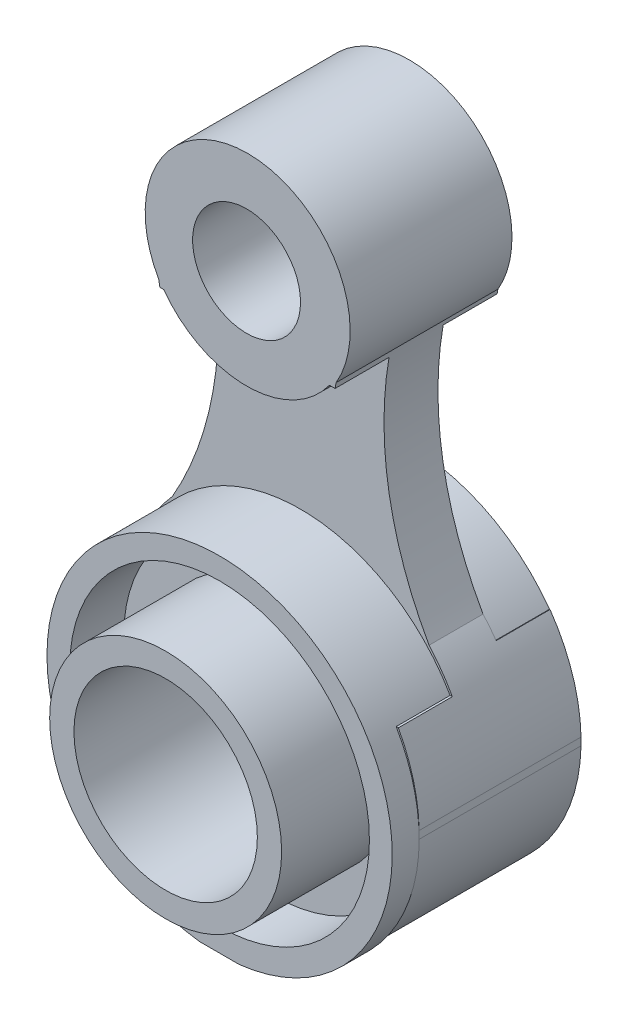
ISO-10303-21;
HEADER;
FILE_DESCRIPTION(('STEP AP214'),'2;1');
FILE_NAME('part.step','',(''),(''),'','','');
FILE_SCHEMA(('AUTOMOTIVE_DESIGN { 1 0 10303 214 1 1 1 1 }'));
ENDSEC;
DATA;
#1=APPLICATION_CONTEXT('core data for automotive mechanical design processes');
#2=APPLICATION_PROTOCOL_DEFINITION('international standard','automotive_design',2000,#1);
#3=PRODUCT_CONTEXT('',#1,'mechanical');
#4=PRODUCT('Part','Part','',(#3));
#5=PRODUCT_RELATED_PRODUCT_CATEGORY('part','',(#4));
#6=PRODUCT_DEFINITION_FORMATION('','',#4);
#7=PRODUCT_DEFINITION_CONTEXT('part definition',#1,'design');
#8=PRODUCT_DEFINITION('design','',#6,#7);
#9=PRODUCT_DEFINITION_SHAPE('','',#8);
#10=(LENGTH_UNIT() NAMED_UNIT(*) SI_UNIT(.MILLI.,.METRE.));
#11=(NAMED_UNIT(*) PLANE_ANGLE_UNIT() SI_UNIT($,.RADIAN.));
#12=(NAMED_UNIT(*) SI_UNIT($,.STERADIAN.) SOLID_ANGLE_UNIT());
#13=UNCERTAINTY_MEASURE_WITH_UNIT(LENGTH_MEASURE(1.E-05),#10,'distance_accuracy_value','');
#14=(GEOMETRIC_REPRESENTATION_CONTEXT(3) GLOBAL_UNCERTAINTY_ASSIGNED_CONTEXT((#13)) GLOBAL_UNIT_ASSIGNED_CONTEXT((#10,
#11,#12)) REPRESENTATION_CONTEXT('',''));
#15=CARTESIAN_POINT('',(0.,0.,0.));
#16=DIRECTION('',(0.,0.,1.));
#17=DIRECTION('',(1.,0.,0.));
#18=AXIS2_PLACEMENT_3D('',#15,#16,#17);
#19=CARTESIAN_POINT('',(-79.2157966897572,22.8891170006504,0.));
#20=DIRECTION('',(0.,0.,1.));
#21=DIRECTION('',(1.,0.,0.));
#22=AXIS2_PLACEMENT_3D('',#19,#20,#21);
#23=CYLINDRICAL_SURFACE('',#22,64.);
#24=CARTESIAN_POINT('',(-79.2157966897572,22.8891170006504,0.));
#25=DIRECTION('',(0.,0.,1.));
#26=DIRECTION('',(1.,0.,0.));
#27=AXIS2_PLACEMENT_3D('',#24,#25,#26);
#28=CIRCLE('',#27,64.);
#29=CARTESIAN_POINT('',(-16.2899481455641,34.5654856567557,0.));
#30=VERTEX_POINT('',#29);
#31=CARTESIAN_POINT('',(-16.1113721325283,33.5583063466604,0.));
#32=VERTEX_POINT('',#31);
#33=EDGE_CURVE('E342',#30,#32,#28,.F.);
#34=ORIENTED_EDGE('',*,*,#33,.T.);
#35=DIRECTION('',(0.,0.,-1.));
#36=VECTOR('',#35,1.);
#37=CARTESIAN_POINT('',(-16.1113721325283,33.5583063466604,10.));
#38=LINE('',#37,#36);
#39=CARTESIAN_POINT('',(-16.1113721325283,33.5583063466604,10.));
#40=VERTEX_POINT('',#39);
#41=EDGE_CURVE('E279',#40,#32,#38,.T.);
#42=ORIENTED_EDGE('',*,*,#41,.F.);
#43=CARTESIAN_POINT('',(-79.2157966897572,22.8891170006504,10.));
#44=DIRECTION('',(0.,0.,-1.));
#45=DIRECTION('',(-1.,0.,0.));
#46=AXIS2_PLACEMENT_3D('',#43,#44,#45);
#47=CIRCLE('',#46,64.);
#48=CARTESIAN_POINT('',(-23.7637123793236,-9.06501177214765,10.));
#49=VERTEX_POINT('',#48);
#50=EDGE_CURVE('E249',#49,#40,#47,.F.);
#51=ORIENTED_EDGE('',*,*,#50,.F.);
#52=DIRECTION('',(0.,0.,1.));
#53=VECTOR('',#52,1.);
#54=CARTESIAN_POINT('',(-23.7637123793236,-9.06501177214765,0.));
#55=LINE('',#54,#53);
#56=CARTESIAN_POINT('',(-23.7637123793236,-9.06501177214764,20.));
#57=VERTEX_POINT('',#56);
#58=EDGE_CURVE('E357',#49,#57,#55,.T.);
#59=ORIENTED_EDGE('',*,*,#58,.T.);
#60=CARTESIAN_POINT('',(-79.2157966897572,22.8891170006504,20.));
#61=DIRECTION('',(0.,0.,1.));
#62=DIRECTION('',(1.,0.,0.));
#63=AXIS2_PLACEMENT_3D('',#60,#61,#62);
#64=CIRCLE('',#63,64.);
#65=CARTESIAN_POINT('',(-16.0773225899418,33.354922671832,20.));
#66=VERTEX_POINT('',#65);
#67=EDGE_CURVE('E288',#66,#57,#64,.F.);
#68=ORIENTED_EDGE('',*,*,#67,.F.);
#69=DIRECTION('',(0.,0.,1.));
#70=VECTOR('',#69,1.);
#71=CARTESIAN_POINT('',(-16.0773225899418,33.354922671832,20.));
#72=LINE('',#71,#70);
#73=CARTESIAN_POINT('',(-16.0773225899418,33.354922671832,30.));
#74=VERTEX_POINT('',#73);
#75=EDGE_CURVE('E329',#66,#74,#72,.T.);
#76=ORIENTED_EDGE('',*,*,#75,.T.);
#77=CARTESIAN_POINT('',(-79.2157966897572,22.8891170006504,30.));
#78=DIRECTION('',(0.,0.,1.));
#79=DIRECTION('',(1.,0.,0.));
#80=AXIS2_PLACEMENT_3D('',#77,#78,#79);
#81=CIRCLE('',#80,64.);
#82=CARTESIAN_POINT('',(-16.2899481455641,34.5654856567557,30.));
#83=VERTEX_POINT('',#82);
#84=EDGE_CURVE('E337',#83,#74,#81,.F.);
#85=ORIENTED_EDGE('',*,*,#84,.F.);
#86=DIRECTION('',(0.,0.,1.));
#87=VECTOR('',#86,1.);
#88=CARTESIAN_POINT('',(-16.2899481455641,34.5654856567557,0.));
#89=LINE('',#88,#87);
#90=EDGE_CURVE('E353',#30,#83,#89,.T.);
#91=ORIENTED_EDGE('',*,*,#90,.F.);
#92=EDGE_LOOP('',(#34,#42,#51,#59,#68,#76,#85,#91));
#93=FACE_BOUND('',#92,.T.);
#94=ADVANCED_FACE('F49',(#93),#23,.F.);
#95=CARTESIAN_POINT('',(79.4760640881105,22.4812265287025,0.));
#96=DIRECTION('',(0.,0.,1.));
#97=DIRECTION('',(1.,0.,0.));
#98=AXIS2_PLACEMENT_3D('',#95,#96,#97);
#99=CYLINDRICAL_SURFACE('',#98,64.);
#100=CARTESIAN_POINT('',(79.4760640881105,22.4812265287025,10.));
#101=DIRECTION('',(0.,0.,-1.));
#102=DIRECTION('',(-1.,0.,0.));
#103=AXIS2_PLACEMENT_3D('',#100,#101,#102);
#104=CIRCLE('',#103,64.);
#105=CARTESIAN_POINT('',(16.4419598055351,33.5583063466604,10.));
#106=VERTEX_POINT('',#105);
#107=CARTESIAN_POINT('',(23.837475779621,-9.14704391149731,10.));
#108=VERTEX_POINT('',#107);
#109=EDGE_CURVE('E64',#106,#108,#104,.F.);
#110=ORIENTED_EDGE('',*,*,#109,.F.);
#111=DIRECTION('',(0.,0.,-1.));
#112=VECTOR('',#111,1.);
#113=CARTESIAN_POINT('',(16.4419598055351,33.5583063466604,10.));
#114=LINE('',#113,#112);
#115=CARTESIAN_POINT('',(16.4419598055351,33.5583063466604,0.));
#116=VERTEX_POINT('',#115);
#117=EDGE_CURVE('E272',#106,#116,#114,.T.);
#118=ORIENTED_EDGE('',*,*,#117,.T.);
#119=CARTESIAN_POINT('',(79.4760640881105,22.4812265287025,0.));
#120=DIRECTION('',(0.,0.,1.));
#121=DIRECTION('',(1.,0.,0.));
#122=AXIS2_PLACEMENT_3D('',#119,#120,#121);
#123=CIRCLE('',#122,64.);
#124=CARTESIAN_POINT('',(16.5943250753563,34.3928552473901,0.));
#125=VERTEX_POINT('',#124);
#126=EDGE_CURVE('E336',#116,#125,#123,.F.);
#127=ORIENTED_EDGE('',*,*,#126,.T.);
#128=DIRECTION('',(0.,0.,1.));
#129=VECTOR('',#128,1.);
#130=CARTESIAN_POINT('',(16.5943250753563,34.3928552473901,0.));
#131=LINE('',#130,#129);
#132=CARTESIAN_POINT('',(16.5943250753563,34.3928552473901,30.));
#133=VERTEX_POINT('',#132);
#134=EDGE_CURVE('E346',#125,#133,#131,.T.);
#135=ORIENTED_EDGE('',*,*,#134,.T.);
#136=CARTESIAN_POINT('',(79.4760640881105,22.4812265287025,30.));
#137=DIRECTION('',(0.,0.,1.));
#138=DIRECTION('',(1.,0.,0.));
#139=AXIS2_PLACEMENT_3D('',#136,#137,#138);
#140=CIRCLE('',#139,64.);
#141=CARTESIAN_POINT('',(16.4065569377697,33.354922671832,30.));
#142=VERTEX_POINT('',#141);
#143=EDGE_CURVE('E317',#142,#133,#140,.F.);
#144=ORIENTED_EDGE('',*,*,#143,.F.);
#145=DIRECTION('',(0.,0.,1.));
#146=VECTOR('',#145,1.);
#147=CARTESIAN_POINT('',(16.4065569377697,33.354922671832,20.));
#148=LINE('',#147,#146);
#149=CARTESIAN_POINT('',(16.4065569377697,33.354922671832,20.));
#150=VERTEX_POINT('',#149);
#151=EDGE_CURVE('E318',#150,#142,#148,.T.);
#152=ORIENTED_EDGE('',*,*,#151,.F.);
#153=CARTESIAN_POINT('',(79.4760640881105,22.4812265287025,20.));
#154=DIRECTION('',(0.,0.,1.));
#155=DIRECTION('',(1.,0.,0.));
#156=AXIS2_PLACEMENT_3D('',#153,#154,#155);
#157=CIRCLE('',#156,64.);
#158=CARTESIAN_POINT('',(23.837475779621,-9.14704391149731,20.));
#159=VERTEX_POINT('',#158);
#160=EDGE_CURVE('E302',#159,#150,#157,.F.);
#161=ORIENTED_EDGE('',*,*,#160,.F.);
#162=DIRECTION('',(0.,0.,1.));
#163=VECTOR('',#162,1.);
#164=CARTESIAN_POINT('',(23.837475779621,-9.14704391149731,0.));
#165=LINE('',#164,#163);
#166=EDGE_CURVE('E359',#108,#159,#165,.T.);
#167=ORIENTED_EDGE('',*,*,#166,.F.);
#168=EDGE_LOOP('',(#110,#118,#127,#135,#144,#152,#161,#167));
#169=FACE_BOUND('',#168,.T.);
#170=ADVANCED_FACE('F488',(#169),#99,.F.);
#171=CARTESIAN_POINT('',(0.,0.,0.));
#172=DIRECTION('',(0.,0.,1.));
#173=DIRECTION('',(1.,0.,0.));
#174=AXIS2_PLACEMENT_3D('',#171,#172,#173);
#175=PLANE('',#174);
#176=CARTESIAN_POINT('',(0.,44.,0.));
#177=DIRECTION('',(0.,0.,1.));
#178=DIRECTION('',(1.,0.,0.));
#179=AXIS2_PLACEMENT_3D('',#176,#177,#178);
#180=CIRCLE('',#179,10.);
#181=CARTESIAN_POINT('',(10.,44.,0.));
#182=VERTEX_POINT('',#181);
#183=EDGE_CURVE('E375',#182,#182,#180,.T.);
#184=ORIENTED_EDGE('',*,*,#183,.T.);
#185=EDGE_LOOP('',(#184));
#186=FACE_BOUND('',#185,.T.);
#187=DIRECTION('',(-1.,0.,0.));
#188=VECTOR('',#187,1.);
#189=CARTESIAN_POINT('',(0.,33.5583063466604,0.));
#190=LINE('',#189,#188);
#191=CARTESIAN_POINT('',(15.5041896160927,33.5583063466604,0.));
#192=VERTEX_POINT('',#191);
#193=EDGE_CURVE('E264',#116,#192,#190,.T.);
#194=ORIENTED_EDGE('',*,*,#193,.T.);
#195=CARTESIAN_POINT('',(0.,44.5410247873855,0.));
#196=DIRECTION('',(0.,0.,-1.));
#197=DIRECTION('',(-1.,0.,0.));
#198=AXIS2_PLACEMENT_3D('',#195,#196,#197);
#199=CIRCLE('',#198,19.);
#200=CARTESIAN_POINT('',(-15.5041896160927,33.5583063466604,0.));
#201=VERTEX_POINT('',#200);
#202=EDGE_CURVE('E263',#192,#201,#199,.T.);
#203=ORIENTED_EDGE('',*,*,#202,.T.);
#204=EDGE_CURVE('E260',#201,#32,#190,.T.);
#205=ORIENTED_EDGE('',*,*,#204,.T.);
#206=ORIENTED_EDGE('',*,*,#33,.F.);
#207=CARTESIAN_POINT('',(0.202169338467999,44.,0.));
#208=DIRECTION('',(0.,0.,1.));
#209=DIRECTION('',(1.,0.,0.));
#210=AXIS2_PLACEMENT_3D('',#207,#208,#209);
#211=CIRCLE('',#210,19.);
#212=EDGE_CURVE('E334',#125,#30,#211,.T.);
#213=ORIENTED_EDGE('',*,*,#212,.F.);
#214=ORIENTED_EDGE('',*,*,#126,.F.);
#215=EDGE_LOOP('',(#194,#203,#205,#206,#213,#214));
#216=FACE_BOUND('',#215,.T.);
#217=ADVANCED_FACE('F481',(#186,#216),#175,.F.);
#218=CARTESIAN_POINT('',(0.,0.,30.));
#219=DIRECTION('',(0.,0.,-1.));
#220=DIRECTION('',(-1.,0.,0.));
#221=AXIS2_PLACEMENT_3D('',#218,#219,#220);
#222=PLANE('',#221);
#223=CARTESIAN_POINT('',(0.,-30.5075512242365,30.));
#224=DIRECTION('',(0.,0.,-1.));
#225=DIRECTION('',(-1.,0.,0.));
#226=AXIS2_PLACEMENT_3D('',#223,#224,#225);
#227=CIRCLE('',#226,32.0077572504167);
#228=CARTESIAN_POINT('',(28.1392759995127,-15.2537756121182,30.));
#229=VERTEX_POINT('',#228);
#230=CARTESIAN_POINT('',(32.,-29.802906489917,30.));
#231=VERTEX_POINT('',#230);
#232=EDGE_CURVE('E57',#229,#231,#227,.T.);
#233=ORIENTED_EDGE('',*,*,#232,.F.);
#234=DIRECTION('',(1.,0.,0.));
#235=VECTOR('',#234,1.);
#236=CARTESIAN_POINT('',(0.,-15.2537756121182,30.));
#237=LINE('',#236,#235);
#238=CARTESIAN_POINT('',(27.7367773911532,-15.2537756121182,30.));
#239=VERTEX_POINT('',#238);
#240=EDGE_CURVE('E313',#239,#229,#237,.T.);
#241=ORIENTED_EDGE('',*,*,#240,.F.);
#242=CARTESIAN_POINT('',(0.,-31.2121959585564,30.));
#243=DIRECTION('',(0.,0.,1.));
#244=DIRECTION('',(1.,0.,0.));
#245=AXIS2_PLACEMENT_3D('',#242,#243,#244);
#246=CIRCLE('',#245,32.);
#247=CARTESIAN_POINT('',(32.,-31.2121959585562,30.));
#248=VERTEX_POINT('',#247);
#249=EDGE_CURVE('E401',#248,#239,#246,.T.);
#250=ORIENTED_EDGE('',*,*,#249,.F.);
#251=DIRECTION('',(0.,-1.,0.));
#252=VECTOR('',#251,1.);
#253=CARTESIAN_POINT('',(32.,63.,30.));
#254=LINE('',#253,#252);
#255=EDGE_CURVE('E412',#231,#248,#254,.T.);
#256=ORIENTED_EDGE('',*,*,#255,.F.);
#257=EDGE_LOOP('',(#233,#241,#250,#256));
#258=FACE_BOUND('',#257,.T.);
#259=ADVANCED_FACE('F442',(#258),#222,.F.);
#260=CARTESIAN_POINT('',(0.,44.,30.));
#261=DIRECTION('',(0.,0.,1.));
#262=DIRECTION('',(1.,0.,0.));
#263=AXIS2_PLACEMENT_3D('',#260,#261,#262);
#264=CIRCLE('',#263,10.);
#265=CARTESIAN_POINT('',(10.,44.,30.));
#266=VERTEX_POINT('',#265);
#267=EDGE_CURVE('E374',#266,#266,#264,.T.);
#268=ORIENTED_EDGE('',*,*,#267,.F.);
#269=EDGE_LOOP('',(#268));
#270=FACE_BOUND('',#269,.T.);
#271=DIRECTION('',(1.,0.,0.));
#272=VECTOR('',#271,1.);
#273=CARTESIAN_POINT('',(0.,33.354922671832,30.));
#274=LINE('',#273,#272);
#275=CARTESIAN_POINT('',(15.3580962186207,33.354922671832,30.));
#276=VERTEX_POINT('',#275);
#277=EDGE_CURVE('E286',#276,#142,#274,.T.);
#278=ORIENTED_EDGE('',*,*,#277,.T.);
#279=ORIENTED_EDGE('',*,*,#143,.T.);
#280=CARTESIAN_POINT('',(0.202169338467999,44.,30.));
#281=DIRECTION('',(0.,0.,-1.));
#282=DIRECTION('',(-1.,0.,0.));
#283=AXIS2_PLACEMENT_3D('',#280,#281,#282);
#284=CIRCLE('',#283,19.);
#285=EDGE_CURVE('E11',#83,#133,#284,.T.);
#286=ORIENTED_EDGE('',*,*,#285,.F.);
#287=ORIENTED_EDGE('',*,*,#84,.T.);
#288=CARTESIAN_POINT('',(-15.3580962186207,33.354922671832,30.));
#289=VERTEX_POINT('',#288);
#290=EDGE_CURVE('E307',#74,#289,#274,.T.);
#291=ORIENTED_EDGE('',*,*,#290,.T.);
#292=CARTESIAN_POINT('',(0.,44.5410247873854,30.));
#293=DIRECTION('',(0.,0.,1.));
#294=DIRECTION('',(1.,0.,0.));
#295=AXIS2_PLACEMENT_3D('',#292,#293,#294);
#296=CIRCLE('',#295,19.);
#297=EDGE_CURVE('E269',#289,#276,#296,.T.);
#298=ORIENTED_EDGE('',*,*,#297,.T.);
#299=EDGE_LOOP('',(#278,#279,#286,#287,#291,#298));
#300=FACE_BOUND('',#299,.T.);
#301=ADVANCED_FACE('F500',(#270,#300),#222,.F.);
#302=CARTESIAN_POINT('',(-32.,63.,45.));
#303=DIRECTION('',(1.,0.,0.));
#304=DIRECTION('',(0.,1.,0.));
#305=AXIS2_PLACEMENT_3D('',#302,#303,#304);
#306=PLANE('',#305);
#307=DIRECTION('',(0.,0.,1.));
#308=VECTOR('',#307,1.);
#309=CARTESIAN_POINT('',(-32.,-29.8029064899161,0.));
#310=LINE('',#309,#308);
#311=CARTESIAN_POINT('',(-32.,-29.8029064899167,0.));
#312=VERTEX_POINT('',#311);
#313=CARTESIAN_POINT('',(-32.,-29.8029064899167,30.));
#314=VERTEX_POINT('',#313);
#315=EDGE_CURVE('E368',#312,#314,#310,.T.);
#316=ORIENTED_EDGE('',*,*,#315,.F.);
#317=DIRECTION('',(0.,-1.,0.));
#318=VECTOR('',#317,1.);
#319=CARTESIAN_POINT('',(-32.,63.,0.));
#320=LINE('',#319,#318);
#321=CARTESIAN_POINT('',(-32.,-31.2121959585563,0.));
#322=VERTEX_POINT('',#321);
#323=EDGE_CURVE('E418',#312,#322,#320,.T.);
#324=ORIENTED_EDGE('',*,*,#323,.T.);
#325=DIRECTION('',(0.,0.,1.));
#326=VECTOR('',#325,1.);
#327=CARTESIAN_POINT('',(-32.,-31.212195958557,0.));
#328=LINE('',#327,#326);
#329=CARTESIAN_POINT('',(-32.,-31.2121959585562,30.));
#330=VERTEX_POINT('',#329);
#331=EDGE_CURVE('E366',#330,#322,#328,.F.);
#332=ORIENTED_EDGE('',*,*,#331,.F.);
#333=DIRECTION('',(0.,1.,0.));
#334=VECTOR('',#333,1.);
#335=CARTESIAN_POINT('',(-32.,63.,30.));
#336=LINE('',#335,#334);
#337=EDGE_CURVE('E415',#330,#314,#336,.T.);
#338=ORIENTED_EDGE('',*,*,#337,.T.);
#339=EDGE_LOOP('',(#316,#324,#332,#338));
#340=FACE_BOUND('',#339,.T.);
#341=ADVANCED_FACE('F51',(#340),#306,.F.);
#342=CARTESIAN_POINT('',(32.,63.,45.));
#343=DIRECTION('',(-1.,0.,0.));
#344=DIRECTION('',(0.,-1.,0.));
#345=AXIS2_PLACEMENT_3D('',#342,#343,#344);
#346=PLANE('',#345);
#347=DIRECTION('',(0.,0.,1.));
#348=VECTOR('',#347,1.);
#349=CARTESIAN_POINT('',(32.,-31.2121959585566,0.));
#350=LINE('',#349,#348);
#351=CARTESIAN_POINT('',(32.,-31.212195958556,0.));
#352=VERTEX_POINT('',#351);
#353=EDGE_CURVE('E364',#352,#248,#350,.T.);
#354=ORIENTED_EDGE('',*,*,#353,.F.);
#355=DIRECTION('',(0.,1.,0.));
#356=VECTOR('',#355,1.);
#357=CARTESIAN_POINT('',(32.,63.,0.));
#358=LINE('',#357,#356);
#359=CARTESIAN_POINT('',(32.,-29.802906489917,0.));
#360=VERTEX_POINT('',#359);
#361=EDGE_CURVE('E421',#352,#360,#358,.T.);
#362=ORIENTED_EDGE('',*,*,#361,.T.);
#363=DIRECTION('',(0.,0.,1.));
#364=VECTOR('',#363,1.);
#365=CARTESIAN_POINT('',(32.,-29.8029064899164,0.));
#366=LINE('',#365,#364);
#367=EDGE_CURVE('E356',#231,#360,#366,.F.);
#368=ORIENTED_EDGE('',*,*,#367,.F.);
#369=ORIENTED_EDGE('',*,*,#255,.T.);
#370=EDGE_LOOP('',(#354,#362,#368,#369));
#371=FACE_BOUND('',#370,.T.);
#372=ADVANCED_FACE('F438',(#371),#346,.F.);
#373=CARTESIAN_POINT('',(-32.,-63.,45.));
#374=DIRECTION('',(0.,1.,0.));
#375=DIRECTION('',(0.,0.,1.));
#376=AXIS2_PLACEMENT_3D('',#373,#374,#375);
#377=PLANE('',#376);
#378=DIRECTION('',(0.,0.,1.));
#379=VECTOR('',#378,1.);
#380=CARTESIAN_POINT('',(-3.679064313488,-63.,30.));
#381=LINE('',#380,#379);
#382=CARTESIAN_POINT('',(-3.679064313488,-63.,30.));
#383=VERTEX_POINT('',#382);
#384=CARTESIAN_POINT('',(-3.67906431348789,-63.,35.));
#385=VERTEX_POINT('',#384);
#386=EDGE_CURVE('E409',#383,#385,#381,.T.);
#387=ORIENTED_EDGE('',*,*,#386,.F.);
#388=DIRECTION('',(1.,0.,0.));
#389=VECTOR('',#388,1.);
#390=CARTESIAN_POINT('',(-32.,-63.,30.));
#391=LINE('',#390,#389);
#392=CARTESIAN_POINT('',(3.679064313488,-63.,30.));
#393=VERTEX_POINT('',#392);
#394=EDGE_CURVE('E371',#383,#393,#391,.T.);
#395=ORIENTED_EDGE('',*,*,#394,.T.);
#396=DIRECTION('',(0.,0.,1.));
#397=VECTOR('',#396,1.);
#398=CARTESIAN_POINT('',(3.679064313488,-63.,30.));
#399=LINE('',#398,#397);
#400=CARTESIAN_POINT('',(3.679064313488,-63.,35.));
#401=VERTEX_POINT('',#400);
#402=EDGE_CURVE('E404',#401,#393,#399,.F.);
#403=ORIENTED_EDGE('',*,*,#402,.F.);
#404=DIRECTION('',(1.,0.,0.));
#405=VECTOR('',#404,1.);
#406=CARTESIAN_POINT('',(0.,-63.,35.));
#407=LINE('',#406,#405);
#408=EDGE_CURVE('E396',#385,#401,#407,.T.);
#409=ORIENTED_EDGE('',*,*,#408,.F.);
#410=EDGE_LOOP('',(#387,#395,#403,#409));
#411=FACE_BOUND('',#410,.T.);
#412=ADVANCED_FACE('F588',(#411),#377,.F.);
#413=CARTESIAN_POINT('',(0.,-31.2121959585564,30.));
#414=DIRECTION('',(0.,0.,1.));
#415=DIRECTION('',(1.,0.,0.));
#416=AXIS2_PLACEMENT_3D('',#413,#414,#415);
#417=CYLINDRICAL_SURFACE('',#416,32.);
#418=ORIENTED_EDGE('',*,*,#386,.T.);
#419=CARTESIAN_POINT('',(0.,-31.2121959585564,35.));
#420=DIRECTION('',(0.,0.,1.));
#421=DIRECTION('',(1.,0.,0.));
#422=AXIS2_PLACEMENT_3D('',#419,#420,#421);
#423=CIRCLE('',#422,32.);
#424=EDGE_CURVE('E398',#401,#385,#423,.T.);
#425=ORIENTED_EDGE('',*,*,#424,.F.);
#426=ORIENTED_EDGE('',*,*,#402,.T.);
#427=EDGE_CURVE('E400',#393,#248,#246,.T.);
#428=ORIENTED_EDGE('',*,*,#427,.T.);
#429=ORIENTED_EDGE('',*,*,#249,.T.);
#430=DIRECTION('',(0.,0.,1.));
#431=VECTOR('',#430,1.);
#432=CARTESIAN_POINT('',(27.7367773911532,-15.2537756121182,20.));
#433=LINE('',#432,#431);
#434=CARTESIAN_POINT('',(27.7367773911532,-15.2537756121182,20.));
#435=VERTEX_POINT('',#434);
#436=EDGE_CURVE('E323',#435,#239,#433,.T.);
#437=ORIENTED_EDGE('',*,*,#436,.F.);
#438=CARTESIAN_POINT('',(0.,-31.2121959585564,20.));
#439=DIRECTION('',(0.,0.,1.));
#440=DIRECTION('',(1.,0.,0.));
#441=AXIS2_PLACEMENT_3D('',#438,#439,#440);
#442=CIRCLE('',#441,32.);
#443=CARTESIAN_POINT('',(-27.7367773911532,-15.2537756121182,20.));
#444=VERTEX_POINT('',#443);
#445=EDGE_CURVE('E298',#444,#435,#442,.F.);
#446=ORIENTED_EDGE('',*,*,#445,.F.);
#447=DIRECTION('',(0.,0.,1.));
#448=VECTOR('',#447,1.);
#449=CARTESIAN_POINT('',(-27.7367773911532,-15.2537756121182,20.));
#450=LINE('',#449,#448);
#451=CARTESIAN_POINT('',(-27.7367773911532,-15.2537756121182,30.));
#452=VERTEX_POINT('',#451);
#453=EDGE_CURVE('E325',#444,#452,#450,.T.);
#454=ORIENTED_EDGE('',*,*,#453,.T.);
#455=EDGE_CURVE('E405',#452,#330,#246,.T.);
#456=ORIENTED_EDGE('',*,*,#455,.T.);
#457=EDGE_CURVE('E406',#330,#383,#246,.T.);
#458=ORIENTED_EDGE('',*,*,#457,.T.);
#459=EDGE_LOOP('',(#418,#425,#426,#428,#429,#437,#446,#454,#456,#458));
#460=FACE_BOUND('',#459,.T.);
#461=ADVANCED_FACE('F444',(#460),#417,.T.);
#462=CARTESIAN_POINT('',(0.203383674828223,-30.9143185738929,0.));
#463=DIRECTION('',(0.,0.,-1.));
#464=DIRECTION('',(-1.,0.,0.));
#465=AXIS2_PLACEMENT_3D('',#462,#463,#464);
#466=CIRCLE('',#465,32.);
#467=CARTESIAN_POINT('',(-25.7559561473682,-12.2030204896945,0.));
#468=VERTEX_POINT('',#467);
#469=CARTESIAN_POINT('',(26.1627234970246,-12.2030204896945,0.));
#470=VERTEX_POINT('',#469);
#471=EDGE_CURVE('E230',#468,#470,#466,.T.);
#472=ORIENTED_EDGE('',*,*,#471,.T.);
#473=DIRECTION('',(-1.,0.,0.));
#474=VECTOR('',#473,1.);
#475=CARTESIAN_POINT('',(0.,-12.2030204896945,0.));
#476=LINE('',#475,#474);
#477=CARTESIAN_POINT('',(26.2572024174284,-12.2030204896945,0.));
#478=VERTEX_POINT('',#477);
#479=EDGE_CURVE('E243',#478,#470,#476,.T.);
#480=ORIENTED_EDGE('',*,*,#479,.F.);
#481=CARTESIAN_POINT('',(0.,-30.5075512242365,0.));
#482=DIRECTION('',(0.,0.,1.));
#483=DIRECTION('',(1.,0.,0.));
#484=AXIS2_PLACEMENT_3D('',#481,#482,#483);
#485=CIRCLE('',#484,32.0077572504167);
#486=EDGE_CURVE('E339',#360,#478,#485,.T.);
#487=ORIENTED_EDGE('',*,*,#486,.F.);
#488=ORIENTED_EDGE('',*,*,#361,.F.);
#489=EDGE_CURVE('E343',#322,#352,#485,.T.);
#490=ORIENTED_EDGE('',*,*,#489,.F.);
#491=ORIENTED_EDGE('',*,*,#323,.F.);
#492=CARTESIAN_POINT('',(-26.2572024174284,-12.2030204896945,0.));
#493=VERTEX_POINT('',#492);
#494=EDGE_CURVE('E340',#493,#312,#485,.T.);
#495=ORIENTED_EDGE('',*,*,#494,.F.);
#496=EDGE_CURVE('E258',#468,#493,#476,.T.);
#497=ORIENTED_EDGE('',*,*,#496,.F.);
#498=EDGE_LOOP('',(#472,#480,#487,#488,#490,#491,#495,#497));
#499=FACE_BOUND('',#498,.T.);
#500=CARTESIAN_POINT('',(0.,-30.9143185738929,0.));
#501=DIRECTION('',(0.,0.,1.));
#502=DIRECTION('',(1.,0.,0.));
#503=AXIS2_PLACEMENT_3D('',#500,#501,#502);
#504=CIRCLE('',#503,17.);
#505=CARTESIAN_POINT('',(17.,-30.9143185738929,0.));
#506=VERTEX_POINT('',#505);
#507=EDGE_CURVE('E381',#506,#506,#504,.T.);
#508=ORIENTED_EDGE('',*,*,#507,.T.);
#509=EDGE_LOOP('',(#508));
#510=FACE_BOUND('',#509,.T.);
#511=ADVANCED_FACE('F473',(#499,#510),#175,.F.);
#512=ORIENTED_EDGE('',*,*,#455,.F.);
#513=CARTESIAN_POINT('',(-28.1392759995127,-15.2537756121182,30.));
#514=VERTEX_POINT('',#513);
#515=EDGE_CURVE('E310',#514,#452,#237,.T.);
#516=ORIENTED_EDGE('',*,*,#515,.F.);
#517=CARTESIAN_POINT('',(0.,-30.5075512242365,30.));
#518=DIRECTION('',(0.,0.,1.));
#519=DIRECTION('',(1.,0.,0.));
#520=AXIS2_PLACEMENT_3D('',#517,#518,#519);
#521=CIRCLE('',#520,32.0077572504167);
#522=EDGE_CURVE('E349',#514,#314,#521,.T.);
#523=ORIENTED_EDGE('',*,*,#522,.T.);
#524=ORIENTED_EDGE('',*,*,#337,.F.);
#525=EDGE_LOOP('',(#512,#516,#523,#524));
#526=FACE_BOUND('',#525,.T.);
#527=ADVANCED_FACE('F466',(#526),#222,.F.);
#528=CARTESIAN_POINT('',(0.,0.,35.));
#529=DIRECTION('',(0.,0.,1.));
#530=DIRECTION('',(1.,0.,0.));
#531=AXIS2_PLACEMENT_3D('',#528,#529,#530);
#532=PLANE('',#531);
#533=CARTESIAN_POINT('',(0.,-31.,35.));
#534=DIRECTION('',(0.,0.,1.));
#535=DIRECTION('',(1.,0.,0.));
#536=AXIS2_PLACEMENT_3D('',#533,#534,#535);
#537=CIRCLE('',#536,27.775);
#538=CARTESIAN_POINT('',(27.775,-31.,35.));
#539=VERTEX_POINT('',#538);
#540=EDGE_CURVE('E395',#539,#539,#537,.T.);
#541=ORIENTED_EDGE('',*,*,#540,.F.);
#542=EDGE_LOOP('',(#541));
#543=FACE_BOUND('',#542,.T.);
#544=ORIENTED_EDGE('',*,*,#408,.T.);
#545=ORIENTED_EDGE('',*,*,#424,.T.);
#546=EDGE_LOOP('',(#544,#545));
#547=FACE_BOUND('',#546,.T.);
#548=ADVANCED_FACE('F581',(#543,#547),#532,.T.);
#549=CARTESIAN_POINT('',(0.,-31.,25.));
#550=DIRECTION('',(0.,0.,1.));
#551=DIRECTION('',(1.,0.,0.));
#552=AXIS2_PLACEMENT_3D('',#549,#550,#551);
#553=CYLINDRICAL_SURFACE('',#552,27.775);
#554=ORIENTED_EDGE('',*,*,#540,.T.);
#555=EDGE_LOOP('',(#554));
#556=FACE_BOUND('',#555,.T.);
#557=CARTESIAN_POINT('',(0.,-31.,25.));
#558=DIRECTION('',(0.,0.,1.));
#559=DIRECTION('',(1.,0.,0.));
#560=AXIS2_PLACEMENT_3D('',#557,#558,#559);
#561=CIRCLE('',#560,27.775);
#562=CARTESIAN_POINT('',(27.775,-31.,25.));
#563=VERTEX_POINT('',#562);
#564=EDGE_CURVE('E390',#563,#563,#561,.T.);
#565=ORIENTED_EDGE('',*,*,#564,.F.);
#566=EDGE_LOOP('',(#565));
#567=FACE_BOUND('',#566,.T.);
#568=ADVANCED_FACE('F577',(#556,#567),#553,.F.);
#569=CARTESIAN_POINT('',(0.,-31.,25.));
#570=DIRECTION('',(0.,0.,1.));
#571=DIRECTION('',(1.,0.,0.));
#572=AXIS2_PLACEMENT_3D('',#569,#570,#571);
#573=PLANE('',#572);
#574=CARTESIAN_POINT('',(0.,-31.,25.));
#575=DIRECTION('',(0.,0.,1.));
#576=DIRECTION('',(1.,0.,0.));
#577=AXIS2_PLACEMENT_3D('',#574,#575,#576);
#578=CIRCLE('',#577,21.5);
#579=CARTESIAN_POINT('',(21.5,-31.,25.));
#580=VERTEX_POINT('',#579);
#581=EDGE_CURVE('E387',#580,#580,#578,.T.);
#582=ORIENTED_EDGE('',*,*,#581,.F.);
#583=EDGE_LOOP('',(#582));
#584=FACE_BOUND('',#583,.T.);
#585=ORIENTED_EDGE('',*,*,#564,.T.);
#586=EDGE_LOOP('',(#585));
#587=FACE_BOUND('',#586,.T.);
#588=ADVANCED_FACE('F573',(#584,#587),#573,.T.);
#589=CARTESIAN_POINT('',(0.,-31.,25.));
#590=DIRECTION('',(0.,0.,1.));
#591=DIRECTION('',(1.,0.,0.));
#592=AXIS2_PLACEMENT_3D('',#589,#590,#591);
#593=CYLINDRICAL_SURFACE('',#592,21.5);
#594=ORIENTED_EDGE('',*,*,#581,.T.);
#595=EDGE_LOOP('',(#594));
#596=FACE_BOUND('',#595,.T.);
#597=CARTESIAN_POINT('',(0.,-31.,45.));
#598=DIRECTION('',(0.,0.,1.));
#599=DIRECTION('',(1.,0.,0.));
#600=AXIS2_PLACEMENT_3D('',#597,#598,#599);
#601=CIRCLE('',#600,21.5);
#602=CARTESIAN_POINT('',(21.5,-31.,45.));
#603=VERTEX_POINT('',#602);
#604=EDGE_CURVE('E384',#603,#603,#601,.T.);
#605=ORIENTED_EDGE('',*,*,#604,.F.);
#606=EDGE_LOOP('',(#605));
#607=FACE_BOUND('',#606,.T.);
#608=ADVANCED_FACE('F570',(#596,#607),#593,.T.);
#609=CARTESIAN_POINT('',(0.,0.,45.));
#610=DIRECTION('',(0.,0.,1.));
#611=DIRECTION('',(1.,0.,0.));
#612=AXIS2_PLACEMENT_3D('',#609,#610,#611);
#613=PLANE('',#612);
#614=CARTESIAN_POINT('',(0.,-30.9143185738929,45.));
#615=DIRECTION('',(0.,0.,1.));
#616=DIRECTION('',(1.,0.,0.));
#617=AXIS2_PLACEMENT_3D('',#614,#615,#616);
#618=CIRCLE('',#617,17.);
#619=CARTESIAN_POINT('',(17.,-30.9143185738929,45.));
#620=VERTEX_POINT('',#619);
#621=EDGE_CURVE('E378',#620,#620,#618,.T.);
#622=ORIENTED_EDGE('',*,*,#621,.F.);
#623=EDGE_LOOP('',(#622));
#624=FACE_BOUND('',#623,.T.);
#625=ORIENTED_EDGE('',*,*,#604,.T.);
#626=EDGE_LOOP('',(#625));
#627=FACE_BOUND('',#626,.T.);
#628=ADVANCED_FACE('F568',(#624,#627),#613,.T.);
#629=CARTESIAN_POINT('',(0.,-30.9143185738929,0.));
#630=DIRECTION('',(0.,0.,1.));
#631=DIRECTION('',(1.,0.,0.));
#632=AXIS2_PLACEMENT_3D('',#629,#630,#631);
#633=CYLINDRICAL_SURFACE('',#632,17.);
#634=CARTESIAN_POINT('',(17.,-30.9143185738929,0.));
#635=CARTESIAN_POINT('',(17.,-30.9143185738929,0.468749999999999));
#636=CARTESIAN_POINT('',(17.,-30.9143185738929,0.9375));
#637=CARTESIAN_POINT('',(17.,-30.9143185738929,1.875));
#638=CARTESIAN_POINT('',(17.,-30.9143185738929,2.34375));
#639=CARTESIAN_POINT('',(17.,-30.9143185738929,3.28125));
#640=CARTESIAN_POINT('',(17.,-30.9143185738929,3.75));
#641=CARTESIAN_POINT('',(17.,-30.9143185738929,4.6875));
#642=CARTESIAN_POINT('',(17.,-30.9143185738929,5.15625));
#643=CARTESIAN_POINT('',(17.,-30.9143185738929,6.09375));
#644=CARTESIAN_POINT('',(17.,-30.9143185738929,6.5625));
#645=CARTESIAN_POINT('',(17.,-30.9143185738929,7.5));
#646=CARTESIAN_POINT('',(17.,-30.9143185738929,7.96875));
#647=CARTESIAN_POINT('',(17.,-30.9143185738929,8.90625));
#648=CARTESIAN_POINT('',(17.,-30.9143185738929,9.375));
#649=CARTESIAN_POINT('',(17.,-30.9143185738929,10.3125));
#650=CARTESIAN_POINT('',(17.,-30.9143185738929,10.78125));
#651=CARTESIAN_POINT('',(17.,-30.9143185738929,11.71875));
#652=CARTESIAN_POINT('',(17.,-30.9143185738929,12.1875));
#653=CARTESIAN_POINT('',(17.,-30.9143185738929,13.125));
#654=CARTESIAN_POINT('',(17.,-30.9143185738929,13.59375));
#655=CARTESIAN_POINT('',(17.,-30.9143185738929,14.53125));
#656=CARTESIAN_POINT('',(17.,-30.9143185738929,15.));
#657=CARTESIAN_POINT('',(17.,-30.9143185738929,15.9375));
#658=CARTESIAN_POINT('',(17.,-30.9143185738929,16.40625));
#659=CARTESIAN_POINT('',(17.,-30.9143185738929,17.34375));
#660=CARTESIAN_POINT('',(17.,-30.9143185738929,17.8125));
#661=CARTESIAN_POINT('',(17.,-30.9143185738929,18.75));
#662=CARTESIAN_POINT('',(17.,-30.9143185738929,19.21875));
#663=CARTESIAN_POINT('',(17.,-30.9143185738929,20.15625));
#664=CARTESIAN_POINT('',(17.,-30.9143185738929,20.625));
#665=CARTESIAN_POINT('',(17.,-30.9143185738929,21.5625));
#666=CARTESIAN_POINT('',(17.,-30.9143185738929,22.03125));
#667=CARTESIAN_POINT('',(17.,-30.9143185738929,22.96875));
#668=CARTESIAN_POINT('',(17.,-30.9143185738929,23.4375));
#669=CARTESIAN_POINT('',(17.,-30.9143185738929,24.375));
#670=CARTESIAN_POINT('',(17.,-30.9143185738929,24.84375));
#671=CARTESIAN_POINT('',(17.,-30.9143185738929,25.78125));
#672=CARTESIAN_POINT('',(17.,-30.9143185738929,26.25));
#673=CARTESIAN_POINT('',(17.,-30.9143185738929,27.1875));
#674=CARTESIAN_POINT('',(17.,-30.9143185738929,27.65625));
#675=CARTESIAN_POINT('',(17.,-30.9143185738929,28.59375));
#676=CARTESIAN_POINT('',(17.,-30.9143185738929,29.0625));
#677=CARTESIAN_POINT('',(17.,-30.9143185738929,30.));
#678=CARTESIAN_POINT('',(17.,-30.9143185738929,30.46875));
#679=CARTESIAN_POINT('',(17.,-30.9143185738929,31.40625));
#680=CARTESIAN_POINT('',(17.,-30.9143185738929,31.875));
#681=CARTESIAN_POINT('',(17.,-30.9143185738929,32.8125));
#682=CARTESIAN_POINT('',(17.,-30.9143185738929,33.28125));
#683=CARTESIAN_POINT('',(17.,-30.9143185738929,34.21875));
#684=CARTESIAN_POINT('',(17.,-30.9143185738929,34.6875));
#685=CARTESIAN_POINT('',(17.,-30.9143185738929,35.625));
#686=CARTESIAN_POINT('',(17.,-30.9143185738929,36.09375));
#687=CARTESIAN_POINT('',(17.,-30.9143185738929,37.03125));
#688=CARTESIAN_POINT('',(17.,-30.9143185738929,37.5));
#689=CARTESIAN_POINT('',(17.,-30.9143185738929,38.4375));
#690=CARTESIAN_POINT('',(17.,-30.9143185738929,38.90625));
#691=CARTESIAN_POINT('',(17.,-30.9143185738929,39.84375));
#692=CARTESIAN_POINT('',(17.,-30.9143185738929,40.3125));
#693=CARTESIAN_POINT('',(17.,-30.9143185738929,41.25));
#694=CARTESIAN_POINT('',(17.,-30.9143185738929,41.71875));
#695=CARTESIAN_POINT('',(17.,-30.9143185738929,42.65625));
#696=CARTESIAN_POINT('',(17.,-30.9143185738929,43.125));
#697=CARTESIAN_POINT('',(17.,-30.9143185738929,44.0625));
#698=CARTESIAN_POINT('',(17.,-30.9143185738929,44.53125));
#699=CARTESIAN_POINT('',(17.,-30.9143185738929,45.));
#700=B_SPLINE_CURVE_WITH_KNOTS('',3,(#634,#635,#636,#637,#638,#639,#640,#641,#642,#643,#644,
#645,#646,#647,#648,#649,#650,#651,#652,#653,#654,#655,#656,#657,#658,#659,#660,#661,#662,#663,
#664,#665,#666,#667,#668,#669,#670,#671,#672,#673,#674,#675,#676,#677,#678,#679,#680,#681,#682,
#683,#684,#685,#686,#687,#688,#689,#690,#691,#692,#693,#694,#695,#696,#697,#698,#699),
.UNSPECIFIED.,.F.,.F.,(4,2,2,2,2,2,2,2,2,2,2,2,2,2,2,2,2,2,2,2,2,2,2,2,2,2,2,2,2,2,2,2,4),(0.,
1.40625,2.8125,4.21875,5.625,7.03125,8.4375,9.84375,11.25,12.65625,14.0625,15.46875,16.875,
18.28125,19.6875,21.09375,22.5,23.90625,25.3125,26.71875,28.125,29.53125,30.9375,32.34375,33.75,
35.15625,36.5625,37.96875,39.375,40.78125,42.1875,43.59375,45.),.UNSPECIFIED.);
#701=EDGE_CURVE('BSEAM564',#506,#620,#700,.T.);
#702=ORIENTED_EDGE('',*,*,#507,.F.);
#703=ORIENTED_EDGE('',*,*,#621,.T.);
#704=ORIENTED_EDGE('',*,*,#701,.T.);
#705=ORIENTED_EDGE('',*,*,#701,.F.);
#706=EDGE_LOOP('',(#702,#704,#703,#705));
#707=FACE_BOUND('',#706,.T.);
#708=ADVANCED_FACE('F564',(#707),#633,.F.);
#709=CARTESIAN_POINT('',(0.,44.,0.));
#710=DIRECTION('',(0.,0.,1.));
#711=DIRECTION('',(1.,0.,0.));
#712=AXIS2_PLACEMENT_3D('',#709,#710,#711);
#713=CYLINDRICAL_SURFACE('',#712,10.);
#714=ORIENTED_EDGE('',*,*,#183,.F.);
#715=EDGE_LOOP('',(#714));
#716=FACE_BOUND('',#715,.T.);
#717=ORIENTED_EDGE('',*,*,#267,.T.);
#718=EDGE_LOOP('',(#717));
#719=FACE_BOUND('',#718,.T.);
#720=ADVANCED_FACE('F558',(#716,#719),#713,.F.);
#721=CARTESIAN_POINT('',(0.,-30.5075512242365,0.));
#722=DIRECTION('',(0.,0.,1.));
#723=DIRECTION('',(1.,0.,0.));
#724=AXIS2_PLACEMENT_3D('',#721,#722,#723);
#725=CYLINDRICAL_SURFACE('',#724,32.0077572504167);
#726=DIRECTION('',(0.,0.,-1.));
#727=VECTOR('',#726,1.);
#728=CARTESIAN_POINT('',(-26.2572024174284,-12.2030204896945,10.));
#729=LINE('',#728,#727);
#730=CARTESIAN_POINT('',(-26.2572024174284,-12.2030204896945,10.));
#731=VERTEX_POINT('',#730);
#732=EDGE_CURVE('E234',#731,#493,#729,.T.);
#733=ORIENTED_EDGE('',*,*,#732,.T.);
#734=ORIENTED_EDGE('',*,*,#494,.T.);
#735=ORIENTED_EDGE('',*,*,#315,.T.);
#736=ORIENTED_EDGE('',*,*,#522,.F.);
#737=DIRECTION('',(0.,0.,1.));
#738=VECTOR('',#737,1.);
#739=CARTESIAN_POINT('',(-28.1392759995127,-15.2537756121182,20.));
#740=LINE('',#739,#738);
#741=CARTESIAN_POINT('',(-28.1392759995127,-15.2537756121182,20.));
#742=VERTEX_POINT('',#741);
#743=EDGE_CURVE('E327',#742,#514,#740,.T.);
#744=ORIENTED_EDGE('',*,*,#743,.F.);
#745=CARTESIAN_POINT('',(0.,-30.5075512242365,20.));
#746=DIRECTION('',(0.,0.,1.));
#747=DIRECTION('',(1.,0.,0.));
#748=AXIS2_PLACEMENT_3D('',#745,#746,#747);
#749=CIRCLE('',#748,32.0077572504167);
#750=EDGE_CURVE('E292',#57,#742,#749,.T.);
#751=ORIENTED_EDGE('',*,*,#750,.F.);
#752=ORIENTED_EDGE('',*,*,#58,.F.);
#753=CARTESIAN_POINT('',(0.,-30.5075512242365,10.));
#754=DIRECTION('',(0.,0.,-1.));
#755=DIRECTION('',(-1.,0.,0.));
#756=AXIS2_PLACEMENT_3D('',#753,#754,#755);
#757=CIRCLE('',#756,32.0077572504167);
#758=EDGE_CURVE('E247',#731,#49,#757,.T.);
#759=ORIENTED_EDGE('',*,*,#758,.F.);
#760=EDGE_LOOP('',(#733,#734,#735,#736,#744,#751,#752,#759));
#761=FACE_BOUND('',#760,.T.);
#762=ADVANCED_FACE('F470',(#761),#725,.T.);
#763=DIRECTION('',(0.,0.,-1.));
#764=VECTOR('',#763,1.);
#765=CARTESIAN_POINT('',(26.2572024174284,-12.2030204896945,10.));
#766=LINE('',#765,#764);
#767=CARTESIAN_POINT('',(26.2572024174284,-12.2030204896945,10.));
#768=VERTEX_POINT('',#767);
#769=EDGE_CURVE('E270',#768,#478,#766,.T.);
#770=ORIENTED_EDGE('',*,*,#769,.F.);
#771=CARTESIAN_POINT('',(0.,-30.5075512242365,10.));
#772=DIRECTION('',(0.,0.,-1.));
#773=DIRECTION('',(-1.,0.,0.));
#774=AXIS2_PLACEMENT_3D('',#771,#772,#773);
#775=CIRCLE('',#774,32.0077572504167);
#776=EDGE_CURVE('E251',#108,#768,#775,.T.);
#777=ORIENTED_EDGE('',*,*,#776,.F.);
#778=ORIENTED_EDGE('',*,*,#166,.T.);
#779=CARTESIAN_POINT('',(0.,-30.5075512242365,20.));
#780=DIRECTION('',(0.,0.,1.));
#781=DIRECTION('',(1.,0.,0.));
#782=AXIS2_PLACEMENT_3D('',#779,#780,#781);
#783=CIRCLE('',#782,32.0077572504167);
#784=CARTESIAN_POINT('',(28.1392759995127,-15.2537756121182,20.));
#785=VERTEX_POINT('',#784);
#786=EDGE_CURVE('E300',#785,#159,#783,.T.);
#787=ORIENTED_EDGE('',*,*,#786,.F.);
#788=DIRECTION('',(0.,0.,1.));
#789=VECTOR('',#788,1.);
#790=CARTESIAN_POINT('',(28.1392759995127,-15.2537756121182,20.));
#791=LINE('',#790,#789);
#792=EDGE_CURVE('E320',#785,#229,#791,.T.);
#793=ORIENTED_EDGE('',*,*,#792,.T.);
#794=ORIENTED_EDGE('',*,*,#232,.T.);
#795=ORIENTED_EDGE('',*,*,#367,.T.);
#796=ORIENTED_EDGE('',*,*,#486,.T.);
#797=EDGE_LOOP('',(#770,#777,#778,#787,#793,#794,#795,#796));
#798=FACE_BOUND('',#797,.T.);
#799=ADVANCED_FACE('F429',(#798),#725,.T.);
#800=CARTESIAN_POINT('',(0.202169338467999,44.,0.));
#801=DIRECTION('',(0.,0.,1.));
#802=DIRECTION('',(1.,0.,0.));
#803=AXIS2_PLACEMENT_3D('',#800,#801,#802);
#804=CYLINDRICAL_SURFACE('',#803,19.);
#805=ORIENTED_EDGE('',*,*,#134,.F.);
#806=ORIENTED_EDGE('',*,*,#212,.T.);
#807=ORIENTED_EDGE('',*,*,#90,.T.);
#808=ORIENTED_EDGE('',*,*,#285,.T.);
#809=EDGE_LOOP('',(#805,#806,#807,#808));
#810=FACE_BOUND('',#809,.T.);
#811=ADVANCED_FACE('F524',(#810),#804,.T.);
#812=CARTESIAN_POINT('',(0.,0.,30.));
#813=DIRECTION('',(0.,0.,1.));
#814=DIRECTION('',(1.,0.,0.));
#815=AXIS2_PLACEMENT_3D('',#812,#813,#814);
#816=PLANE('',#815);
#817=ORIENTED_EDGE('',*,*,#457,.F.);
#818=EDGE_CURVE('E348',#330,#248,#521,.T.);
#819=ORIENTED_EDGE('',*,*,#818,.T.);
#820=ORIENTED_EDGE('',*,*,#427,.F.);
#821=ORIENTED_EDGE('',*,*,#394,.F.);
#822=EDGE_LOOP('',(#817,#819,#820,#821));
#823=FACE_BOUND('',#822,.T.);
#824=ADVANCED_FACE('F458',(#823),#816,.F.);
#825=ORIENTED_EDGE('',*,*,#331,.T.);
#826=ORIENTED_EDGE('',*,*,#489,.T.);
#827=ORIENTED_EDGE('',*,*,#353,.T.);
#828=ORIENTED_EDGE('',*,*,#818,.F.);
#829=EDGE_LOOP('',(#825,#826,#827,#828));
#830=FACE_BOUND('',#829,.T.);
#831=ADVANCED_FACE('F461',(#830),#725,.T.);
#832=CARTESIAN_POINT('',(0.,44.5410247873854,20.));
#833=DIRECTION('',(0.,0.,1.));
#834=DIRECTION('',(1.,0.,0.));
#835=AXIS2_PLACEMENT_3D('',#832,#833,#834);
#836=CYLINDRICAL_SURFACE('',#835,19.);
#837=ORIENTED_EDGE('',*,*,#297,.F.);
#838=DIRECTION('',(0.,0.,1.));
#839=VECTOR('',#838,1.);
#840=CARTESIAN_POINT('',(-15.3580962186207,33.354922671832,20.));
#841=LINE('',#840,#839);
#842=CARTESIAN_POINT('',(-15.3580962186207,33.354922671832,20.));
#843=VERTEX_POINT('',#842);
#844=EDGE_CURVE('E332',#843,#289,#841,.T.);
#845=ORIENTED_EDGE('',*,*,#844,.F.);
#846=CARTESIAN_POINT('',(0.,44.5410247873854,20.));
#847=DIRECTION('',(0.,0.,1.));
#848=DIRECTION('',(1.,0.,0.));
#849=AXIS2_PLACEMENT_3D('',#846,#847,#848);
#850=CIRCLE('',#849,19.);
#851=CARTESIAN_POINT('',(15.3580962186207,33.354922671832,20.));
#852=VERTEX_POINT('',#851);
#853=EDGE_CURVE('E282',#843,#852,#850,.T.);
#854=ORIENTED_EDGE('',*,*,#853,.T.);
#855=DIRECTION('',(0.,0.,1.));
#856=VECTOR('',#855,1.);
#857=CARTESIAN_POINT('',(15.3580962186207,33.354922671832,20.));
#858=LINE('',#857,#856);
#859=EDGE_CURVE('E314',#852,#276,#858,.T.);
#860=ORIENTED_EDGE('',*,*,#859,.T.);
#861=EDGE_LOOP('',(#837,#845,#854,#860));
#862=FACE_BOUND('',#861,.T.);
#863=ADVANCED_FACE('F519',(#862),#836,.T.);
#864=CARTESIAN_POINT('',(0.,33.354922671832,20.));
#865=DIRECTION('',(0.,-1.,0.));
#866=DIRECTION('',(0.,0.,-1.));
#867=AXIS2_PLACEMENT_3D('',#864,#865,#866);
#868=PLANE('',#867);
#869=ORIENTED_EDGE('',*,*,#277,.F.);
#870=ORIENTED_EDGE('',*,*,#859,.F.);
#871=DIRECTION('',(1.,0.,0.));
#872=VECTOR('',#871,1.);
#873=CARTESIAN_POINT('',(0.,33.354922671832,20.));
#874=LINE('',#873,#872);
#875=EDGE_CURVE('E289',#852,#150,#874,.T.);
#876=ORIENTED_EDGE('',*,*,#875,.T.);
#877=ORIENTED_EDGE('',*,*,#151,.T.);
#878=EDGE_LOOP('',(#869,#870,#876,#877));
#879=FACE_BOUND('',#878,.T.);
#880=ADVANCED_FACE('F497',(#879),#868,.T.);
#881=CARTESIAN_POINT('',(0.,-15.2537756121182,20.));
#882=DIRECTION('',(0.,-1.,0.));
#883=DIRECTION('',(0.,0.,-1.));
#884=AXIS2_PLACEMENT_3D('',#881,#882,#883);
#885=PLANE('',#884);
#886=ORIENTED_EDGE('',*,*,#240,.T.);
#887=ORIENTED_EDGE('',*,*,#792,.F.);
#888=DIRECTION('',(1.,0.,0.));
#889=VECTOR('',#888,1.);
#890=CARTESIAN_POINT('',(0.,-15.2537756121182,20.));
#891=LINE('',#890,#889);
#892=EDGE_CURVE('E72',#435,#785,#891,.T.);
#893=ORIENTED_EDGE('',*,*,#892,.F.);
#894=ORIENTED_EDGE('',*,*,#436,.T.);
#895=EDGE_LOOP('',(#886,#887,#893,#894));
#896=FACE_BOUND('',#895,.T.);
#897=ADVANCED_FACE('F504',(#896),#885,.F.);
#898=ORIENTED_EDGE('',*,*,#515,.T.);
#899=ORIENTED_EDGE('',*,*,#453,.F.);
#900=EDGE_CURVE('E295',#742,#444,#891,.T.);
#901=ORIENTED_EDGE('',*,*,#900,.F.);
#902=ORIENTED_EDGE('',*,*,#743,.T.);
#903=EDGE_LOOP('',(#898,#899,#901,#902));
#904=FACE_BOUND('',#903,.T.);
#905=ADVANCED_FACE('F507',(#904),#885,.F.);
#906=ORIENTED_EDGE('',*,*,#290,.F.);
#907=ORIENTED_EDGE('',*,*,#75,.F.);
#908=EDGE_CURVE('E285',#66,#843,#874,.T.);
#909=ORIENTED_EDGE('',*,*,#908,.T.);
#910=ORIENTED_EDGE('',*,*,#844,.T.);
#911=EDGE_LOOP('',(#906,#907,#909,#910));
#912=FACE_BOUND('',#911,.T.);
#913=ADVANCED_FACE('F517',(#912),#868,.T.);
#914=CARTESIAN_POINT('',(0.,0.,20.));
#915=DIRECTION('',(0.,0.,1.));
#916=DIRECTION('',(1.,0.,0.));
#917=AXIS2_PLACEMENT_3D('',#914,#915,#916);
#918=PLANE('',#917);
#919=ORIENTED_EDGE('',*,*,#853,.F.);
#920=ORIENTED_EDGE('',*,*,#908,.F.);
#921=ORIENTED_EDGE('',*,*,#67,.T.);
#922=ORIENTED_EDGE('',*,*,#750,.T.);
#923=ORIENTED_EDGE('',*,*,#900,.T.);
#924=ORIENTED_EDGE('',*,*,#445,.T.);
#925=ORIENTED_EDGE('',*,*,#892,.T.);
#926=ORIENTED_EDGE('',*,*,#786,.T.);
#927=ORIENTED_EDGE('',*,*,#160,.T.);
#928=ORIENTED_EDGE('',*,*,#875,.F.);
#929=EDGE_LOOP('',(#919,#920,#921,#922,#923,#924,#925,#926,#927,#928));
#930=FACE_BOUND('',#929,.T.);
#931=ADVANCED_FACE('F493',(#930),#918,.T.);
#932=CARTESIAN_POINT('',(0.203383674828223,-30.9143185738929,10.));
#933=DIRECTION('',(0.,0.,-1.));
#934=DIRECTION('',(-1.,0.,0.));
#935=AXIS2_PLACEMENT_3D('',#932,#933,#934);
#936=CYLINDRICAL_SURFACE('',#935,32.);
#937=ORIENTED_EDGE('',*,*,#471,.F.);
#938=DIRECTION('',(0.,0.,-1.));
#939=VECTOR('',#938,1.);
#940=CARTESIAN_POINT('',(-25.7559561473682,-12.2030204896945,10.));
#941=LINE('',#940,#939);
#942=CARTESIAN_POINT('',(-25.7559561473682,-12.2030204896945,10.));
#943=VERTEX_POINT('',#942);
#944=EDGE_CURVE('E224',#943,#468,#941,.T.);
#945=ORIENTED_EDGE('',*,*,#944,.F.);
#946=CARTESIAN_POINT('',(0.203383674828223,-30.9143185738929,10.));
#947=DIRECTION('',(0.,0.,-1.));
#948=DIRECTION('',(-1.,0.,0.));
#949=AXIS2_PLACEMENT_3D('',#946,#947,#948);
#950=CIRCLE('',#949,32.);
#951=CARTESIAN_POINT('',(26.1627234970246,-12.2030204896945,10.));
#952=VERTEX_POINT('',#951);
#953=EDGE_CURVE('E227',#943,#952,#950,.T.);
#954=ORIENTED_EDGE('',*,*,#953,.T.);
#955=DIRECTION('',(0.,0.,-1.));
#956=VECTOR('',#955,1.);
#957=CARTESIAN_POINT('',(26.1627234970246,-12.2030204896945,10.));
#958=LINE('',#957,#956);
#959=EDGE_CURVE('E267',#952,#470,#958,.T.);
#960=ORIENTED_EDGE('',*,*,#959,.T.);
#961=EDGE_LOOP('',(#937,#945,#954,#960));
#962=FACE_BOUND('',#961,.T.);
#963=ADVANCED_FACE('F226',(#962),#936,.T.);
#964=CARTESIAN_POINT('',(0.,-12.2030204896945,10.));
#965=DIRECTION('',(0.,-1.,0.));
#966=DIRECTION('',(0.,0.,-1.));
#967=AXIS2_PLACEMENT_3D('',#964,#965,#966);
#968=PLANE('',#967);
#969=ORIENTED_EDGE('',*,*,#479,.T.);
#970=ORIENTED_EDGE('',*,*,#959,.F.);
#971=DIRECTION('',(-1.,0.,0.));
#972=VECTOR('',#971,1.);
#973=CARTESIAN_POINT('',(0.,-12.2030204896945,10.));
#974=LINE('',#973,#972);
#975=EDGE_CURVE('E235',#768,#952,#974,.T.);
#976=ORIENTED_EDGE('',*,*,#975,.F.);
#977=ORIENTED_EDGE('',*,*,#769,.T.);
#978=EDGE_LOOP('',(#969,#970,#976,#977));
#979=FACE_BOUND('',#978,.T.);
#980=ADVANCED_FACE('F546',(#979),#968,.F.);
#981=CARTESIAN_POINT('',(0.,33.5583063466604,10.));
#982=DIRECTION('',(0.,-1.,0.));
#983=DIRECTION('',(0.,0.,-1.));
#984=AXIS2_PLACEMENT_3D('',#981,#982,#983);
#985=PLANE('',#984);
#986=ORIENTED_EDGE('',*,*,#193,.F.);
#987=ORIENTED_EDGE('',*,*,#117,.F.);
#988=DIRECTION('',(-1.,0.,0.));
#989=VECTOR('',#988,1.);
#990=CARTESIAN_POINT('',(0.,33.5583063466604,10.));
#991=LINE('',#990,#989);
#992=CARTESIAN_POINT('',(15.5041896160927,33.5583063466604,10.));
#993=VERTEX_POINT('',#992);
#994=EDGE_CURVE('E253',#106,#993,#991,.T.);
#995=ORIENTED_EDGE('',*,*,#994,.T.);
#996=DIRECTION('',(0.,0.,-1.));
#997=VECTOR('',#996,1.);
#998=CARTESIAN_POINT('',(15.5041896160927,33.5583063466604,10.));
#999=LINE('',#998,#997);
#1000=EDGE_CURVE('E275',#993,#192,#999,.T.);
#1001=ORIENTED_EDGE('',*,*,#1000,.T.);
#1002=EDGE_LOOP('',(#986,#987,#995,#1001));
#1003=FACE_BOUND('',#1002,.T.);
#1004=ADVANCED_FACE('F485',(#1003),#985,.T.);
#1005=CARTESIAN_POINT('',(0.,44.5410247873855,10.));
#1006=DIRECTION('',(0.,0.,-1.));
#1007=DIRECTION('',(-1.,0.,0.));
#1008=AXIS2_PLACEMENT_3D('',#1005,#1006,#1007);
#1009=CYLINDRICAL_SURFACE('',#1008,19.);
#1010=ORIENTED_EDGE('',*,*,#202,.F.);
#1011=ORIENTED_EDGE('',*,*,#1000,.F.);
#1012=CARTESIAN_POINT('',(0.,44.5410247873855,10.));
#1013=DIRECTION('',(0.,0.,-1.));
#1014=DIRECTION('',(-1.,0.,0.));
#1015=AXIS2_PLACEMENT_3D('',#1012,#1013,#1014);
#1016=CIRCLE('',#1015,19.);
#1017=CARTESIAN_POINT('',(-15.5041896160927,33.5583063466604,10.));
#1018=VERTEX_POINT('',#1017);
#1019=EDGE_CURVE('E532',#993,#1018,#1016,.T.);
#1020=ORIENTED_EDGE('',*,*,#1019,.T.);
#1021=DIRECTION('',(0.,0.,-1.));
#1022=VECTOR('',#1021,1.);
#1023=CARTESIAN_POINT('',(-15.5041896160927,33.5583063466604,10.));
#1024=LINE('',#1023,#1022);
#1025=EDGE_CURVE('E277',#1018,#201,#1024,.T.);
#1026=ORIENTED_EDGE('',*,*,#1025,.T.);
#1027=EDGE_LOOP('',(#1010,#1011,#1020,#1026));
#1028=FACE_BOUND('',#1027,.T.);
#1029=ADVANCED_FACE('F536',(#1028),#1009,.T.);
#1030=ORIENTED_EDGE('',*,*,#204,.F.);
#1031=ORIENTED_EDGE('',*,*,#1025,.F.);
#1032=EDGE_CURVE('E530',#1018,#40,#991,.T.);
#1033=ORIENTED_EDGE('',*,*,#1032,.T.);
#1034=ORIENTED_EDGE('',*,*,#41,.T.);
#1035=EDGE_LOOP('',(#1030,#1031,#1033,#1034));
#1036=FACE_BOUND('',#1035,.T.);
#1037=ADVANCED_FACE('F527',(#1036),#985,.T.);
#1038=ORIENTED_EDGE('',*,*,#496,.T.);
#1039=ORIENTED_EDGE('',*,*,#732,.F.);
#1040=EDGE_CURVE('E240',#943,#731,#974,.T.);
#1041=ORIENTED_EDGE('',*,*,#1040,.F.);
#1042=ORIENTED_EDGE('',*,*,#944,.T.);
#1043=EDGE_LOOP('',(#1038,#1039,#1041,#1042));
#1044=FACE_BOUND('',#1043,.T.);
#1045=ADVANCED_FACE('F245',(#1044),#968,.F.);
#1046=CARTESIAN_POINT('',(0.,0.,10.));
#1047=DIRECTION('',(0.,0.,-1.));
#1048=DIRECTION('',(-1.,0.,0.));
#1049=AXIS2_PLACEMENT_3D('',#1046,#1047,#1048);
#1050=PLANE('',#1049);
#1051=ORIENTED_EDGE('',*,*,#953,.F.);
#1052=ORIENTED_EDGE('',*,*,#1040,.T.);
#1053=ORIENTED_EDGE('',*,*,#758,.T.);
#1054=ORIENTED_EDGE('',*,*,#50,.T.);
#1055=ORIENTED_EDGE('',*,*,#1032,.F.);
#1056=ORIENTED_EDGE('',*,*,#1019,.F.);
#1057=ORIENTED_EDGE('',*,*,#994,.F.);
#1058=ORIENTED_EDGE('',*,*,#109,.T.);
#1059=ORIENTED_EDGE('',*,*,#776,.T.);
#1060=ORIENTED_EDGE('',*,*,#975,.T.);
#1061=EDGE_LOOP('',(#1051,#1052,#1053,#1054,#1055,#1056,#1057,#1058,#1059,#1060));
#1062=FACE_BOUND('',#1061,.T.);
#1063=ADVANCED_FACE('F239',(#1062),#1050,.T.);
#1064=CLOSED_SHELL('',(#94,#170,#217,#259,#301,#341,#372,#412,#461,#511,#527,#548,#568,#588,
#608,#628,#708,#720,#762,#799,#811,#824,#831,#863,#880,#897,#905,#913,#931,#963,#980,#1004,
#1029,#1037,#1045,#1063));
#1065=MANIFOLD_SOLID_BREP('B2',#1064);
#1066=ADVANCED_BREP_SHAPE_REPRESENTATION('',(#18,#1065),#14);
#1067=SHAPE_DEFINITION_REPRESENTATION(#9,#1066);
ENDSEC;
END-ISO-10303-21;
